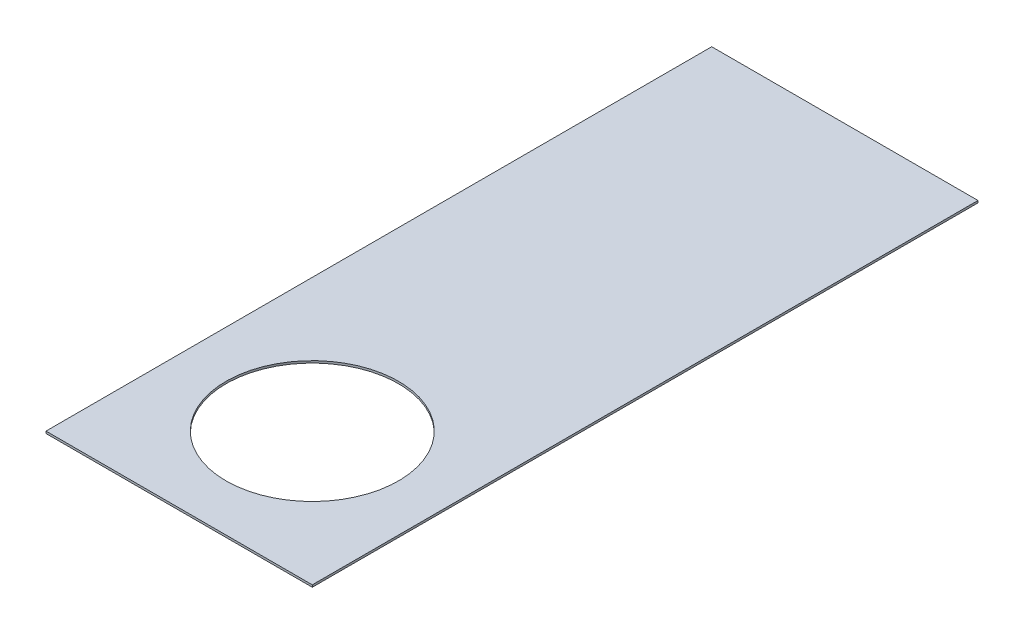
ISO-10303-21;
HEADER;
FILE_DESCRIPTION(('STEP AP214'),'2;1');
FILE_NAME('part.step','',(''),(''),'','','');
FILE_SCHEMA(('AUTOMOTIVE_DESIGN { 1 0 10303 214 1 1 1 1 }'));
ENDSEC;
DATA;
#1=APPLICATION_CONTEXT('core data for automotive mechanical design processes');
#2=APPLICATION_PROTOCOL_DEFINITION('international standard','automotive_design',2000,#1);
#3=PRODUCT_CONTEXT('',#1,'mechanical');
#4=PRODUCT('Part','Part','',(#3));
#5=PRODUCT_RELATED_PRODUCT_CATEGORY('part','',(#4));
#6=PRODUCT_DEFINITION_FORMATION('','',#4);
#7=PRODUCT_DEFINITION_CONTEXT('part definition',#1,'design');
#8=PRODUCT_DEFINITION('design','',#6,#7);
#9=PRODUCT_DEFINITION_SHAPE('','',#8);
#10=(LENGTH_UNIT() NAMED_UNIT(*) SI_UNIT(.MILLI.,.METRE.));
#11=(NAMED_UNIT(*) PLANE_ANGLE_UNIT() SI_UNIT($,.RADIAN.));
#12=(NAMED_UNIT(*) SI_UNIT($,.STERADIAN.) SOLID_ANGLE_UNIT());
#13=UNCERTAINTY_MEASURE_WITH_UNIT(LENGTH_MEASURE(1.E-05),#10,'distance_accuracy_value','');
#14=(GEOMETRIC_REPRESENTATION_CONTEXT(3) GLOBAL_UNCERTAINTY_ASSIGNED_CONTEXT((#13)) GLOBAL_UNIT_ASSIGNED_CONTEXT((#10,
#11,#12)) REPRESENTATION_CONTEXT('',''));
#15=CARTESIAN_POINT('',(0.,0.,0.));
#16=DIRECTION('',(0.,0.,1.));
#17=DIRECTION('',(1.,0.,0.));
#18=AXIS2_PLACEMENT_3D('',#15,#16,#17);
#19=CARTESIAN_POINT('',(1.5875,0.0254,-3.96875));
#20=DIRECTION('',(-1.,0.,0.));
#21=DIRECTION('',(0.,0.,1.));
#22=AXIS2_PLACEMENT_3D('',#19,#20,#21);
#23=PLANE('',#22);
#24=DIRECTION('',(0.,0.,-1.));
#25=VECTOR('',#24,1.);
#26=CARTESIAN_POINT('',(1.5875,0.,-3.96875));
#27=LINE('',#26,#25);
#28=CARTESIAN_POINT('',(1.5875,0.,3.96875));
#29=VERTEX_POINT('',#28);
#30=CARTESIAN_POINT('',(1.5875,0.,-3.96875));
#31=VERTEX_POINT('',#30);
#32=EDGE_CURVE('E96',#29,#31,#27,.T.);
#33=ORIENTED_EDGE('',*,*,#32,.T.);
#34=DIRECTION('',(0.,-1.,0.));
#35=VECTOR('',#34,1.);
#36=CARTESIAN_POINT('',(1.5875,0.0254,-3.96875));
#37=LINE('',#36,#35);
#38=CARTESIAN_POINT('',(1.5875,0.0254,-3.96875));
#39=VERTEX_POINT('',#38);
#40=EDGE_CURVE('E11',#39,#31,#37,.T.);
#41=ORIENTED_EDGE('',*,*,#40,.F.);
#42=DIRECTION('',(0.,0.,-1.));
#43=VECTOR('',#42,1.);
#44=CARTESIAN_POINT('',(1.5875,0.0254,-3.96875));
#45=LINE('',#44,#43);
#46=CARTESIAN_POINT('',(1.5875,0.0254,3.96875));
#47=VERTEX_POINT('',#46);
#48=EDGE_CURVE('E84',#47,#39,#45,.T.);
#49=ORIENTED_EDGE('',*,*,#48,.F.);
#50=DIRECTION('',(0.,-1.,0.));
#51=VECTOR('',#50,1.);
#52=CARTESIAN_POINT('',(1.5875,0.0254,3.96875));
#53=LINE('',#52,#51);
#54=EDGE_CURVE('E92',#47,#29,#53,.T.);
#55=ORIENTED_EDGE('',*,*,#54,.T.);
#56=EDGE_LOOP('',(#33,#41,#49,#55));
#57=FACE_BOUND('',#56,.T.);
#58=ADVANCED_FACE('F33',(#57),#23,.F.);
#59=CARTESIAN_POINT('',(-1.5875,0.0254,-3.96875));
#60=DIRECTION('',(0.,0.,1.));
#61=DIRECTION('',(1.,0.,0.));
#62=AXIS2_PLACEMENT_3D('',#59,#60,#61);
#63=PLANE('',#62);
#64=DIRECTION('',(-1.,0.,0.));
#65=VECTOR('',#64,1.);
#66=CARTESIAN_POINT('',(-1.5875,0.,-3.96875));
#67=LINE('',#66,#65);
#68=CARTESIAN_POINT('',(-1.5875,0.,-3.96875));
#69=VERTEX_POINT('',#68);
#70=EDGE_CURVE('E88',#31,#69,#67,.T.);
#71=ORIENTED_EDGE('',*,*,#70,.T.);
#72=DIRECTION('',(0.,-1.,0.));
#73=VECTOR('',#72,1.);
#74=CARTESIAN_POINT('',(-1.5875,0.0254,-3.96875));
#75=LINE('',#74,#73);
#76=CARTESIAN_POINT('',(-1.5875,0.0254,-3.96875));
#77=VERTEX_POINT('',#76);
#78=EDGE_CURVE('E41',#77,#69,#75,.T.);
#79=ORIENTED_EDGE('',*,*,#78,.F.);
#80=DIRECTION('',(-1.,0.,0.));
#81=VECTOR('',#80,1.);
#82=CARTESIAN_POINT('',(-1.5875,0.0254,-3.96875));
#83=LINE('',#82,#81);
#84=EDGE_CURVE('E79',#39,#77,#83,.T.);
#85=ORIENTED_EDGE('',*,*,#84,.F.);
#86=ORIENTED_EDGE('',*,*,#40,.T.);
#87=EDGE_LOOP('',(#71,#79,#85,#86));
#88=FACE_BOUND('',#87,.T.);
#89=ADVANCED_FACE('F87',(#88),#63,.F.);
#90=CARTESIAN_POINT('',(-1.5875,0.0254,-3.96875));
#91=DIRECTION('',(1.,0.,0.));
#92=DIRECTION('',(0.,0.,-1.));
#93=AXIS2_PLACEMENT_3D('',#90,#91,#92);
#94=PLANE('',#93);
#95=DIRECTION('',(0.,0.,1.));
#96=VECTOR('',#95,1.);
#97=CARTESIAN_POINT('',(-1.5875,0.,-3.96875));
#98=LINE('',#97,#96);
#99=CARTESIAN_POINT('',(-1.5875,0.,3.96875));
#100=VERTEX_POINT('',#99);
#101=EDGE_CURVE('E66',#69,#100,#98,.T.);
#102=ORIENTED_EDGE('',*,*,#101,.T.);
#103=DIRECTION('',(0.,-1.,0.));
#104=VECTOR('',#103,1.);
#105=CARTESIAN_POINT('',(-1.5875,0.0254,3.96875));
#106=LINE('',#105,#104);
#107=CARTESIAN_POINT('',(-1.5875,0.0254,3.96875));
#108=VERTEX_POINT('',#107);
#109=EDGE_CURVE('E89',#108,#100,#106,.T.);
#110=ORIENTED_EDGE('',*,*,#109,.F.);
#111=DIRECTION('',(0.,0.,1.));
#112=VECTOR('',#111,1.);
#113=CARTESIAN_POINT('',(-1.5875,0.0254,-3.96875));
#114=LINE('',#113,#112);
#115=EDGE_CURVE('E82',#77,#108,#114,.T.);
#116=ORIENTED_EDGE('',*,*,#115,.F.);
#117=ORIENTED_EDGE('',*,*,#78,.T.);
#118=EDGE_LOOP('',(#102,#110,#116,#117));
#119=FACE_BOUND('',#118,.T.);
#120=ADVANCED_FACE('F90',(#119),#94,.F.);
#121=CARTESIAN_POINT('',(-1.5875,0.0254,3.96875));
#122=DIRECTION('',(0.,0.,-1.));
#123=DIRECTION('',(-1.,0.,0.));
#124=AXIS2_PLACEMENT_3D('',#121,#122,#123);
#125=PLANE('',#124);
#126=DIRECTION('',(1.,0.,0.));
#127=VECTOR('',#126,1.);
#128=CARTESIAN_POINT('',(-1.5875,0.,3.96875));
#129=LINE('',#128,#127);
#130=EDGE_CURVE('E72',#100,#29,#129,.T.);
#131=ORIENTED_EDGE('',*,*,#130,.T.);
#132=ORIENTED_EDGE('',*,*,#54,.F.);
#133=DIRECTION('',(1.,0.,0.));
#134=VECTOR('',#133,1.);
#135=CARTESIAN_POINT('',(-1.5875,0.0254,3.96875));
#136=LINE('',#135,#134);
#137=EDGE_CURVE('E49',#108,#47,#136,.T.);
#138=ORIENTED_EDGE('',*,*,#137,.F.);
#139=ORIENTED_EDGE('',*,*,#109,.T.);
#140=EDGE_LOOP('',(#131,#132,#138,#139));
#141=FACE_BOUND('',#140,.T.);
#142=ADVANCED_FACE('F104',(#141),#125,.F.);
#143=CARTESIAN_POINT('',(0.,0.0254,0.));
#144=DIRECTION('',(0.,1.,0.));
#145=DIRECTION('',(0.,0.,1.));
#146=AXIS2_PLACEMENT_3D('',#143,#144,#145);
#147=PLANE('',#146);
#148=CARTESIAN_POINT('',(0.,0.0254000000000001,2.38125));
#149=DIRECTION('',(0.,1.,0.));
#150=DIRECTION('',(0.,0.,1.));
#151=AXIS2_PLACEMENT_3D('',#148,#149,#150);
#152=CIRCLE('',#151,1.0287);
#153=CARTESIAN_POINT('',(0.,0.0254000000000001,3.40995));
#154=VERTEX_POINT('',#153);
#155=EDGE_CURVE('E112',#154,#154,#152,.T.);
#156=ORIENTED_EDGE('',*,*,#155,.F.);
#157=EDGE_LOOP('',(#156));
#158=FACE_BOUND('',#157,.T.);
#159=ORIENTED_EDGE('',*,*,#48,.T.);
#160=ORIENTED_EDGE('',*,*,#84,.T.);
#161=ORIENTED_EDGE('',*,*,#115,.T.);
#162=ORIENTED_EDGE('',*,*,#137,.T.);
#163=EDGE_LOOP('',(#159,#160,#161,#162));
#164=FACE_BOUND('',#163,.T.);
#165=ADVANCED_FACE('F80',(#158,#164),#147,.T.);
#166=CARTESIAN_POINT('',(0.,0.,0.));
#167=DIRECTION('',(0.,1.,0.));
#168=DIRECTION('',(0.,0.,1.));
#169=AXIS2_PLACEMENT_3D('',#166,#167,#168);
#170=PLANE('',#169);
#171=CARTESIAN_POINT('',(0.,0.,2.38125));
#172=DIRECTION('',(0.,1.,0.));
#173=DIRECTION('',(0.,0.,1.));
#174=AXIS2_PLACEMENT_3D('',#171,#172,#173);
#175=CIRCLE('',#174,1.0287);
#176=CARTESIAN_POINT('',(0.,0.,3.40995));
#177=VERTEX_POINT('',#176);
#178=EDGE_CURVE('E99',#177,#177,#175,.T.);
#179=ORIENTED_EDGE('',*,*,#178,.T.);
#180=EDGE_LOOP('',(#179));
#181=FACE_BOUND('',#180,.T.);
#182=ORIENTED_EDGE('',*,*,#32,.F.);
#183=ORIENTED_EDGE('',*,*,#130,.F.);
#184=ORIENTED_EDGE('',*,*,#101,.F.);
#185=ORIENTED_EDGE('',*,*,#70,.F.);
#186=EDGE_LOOP('',(#182,#183,#184,#185));
#187=FACE_BOUND('',#186,.T.);
#188=ADVANCED_FACE('F107',(#181,#187),#170,.F.);
#189=CARTESIAN_POINT('',(0.,0.0254,2.38125));
#190=DIRECTION('',(0.,1.,0.));
#191=DIRECTION('',(0.,0.,1.));
#192=AXIS2_PLACEMENT_3D('',#189,#190,#191);
#193=CYLINDRICAL_SURFACE('',#192,1.0287);
#194=ORIENTED_EDGE('',*,*,#178,.F.);
#195=EDGE_LOOP('',(#194));
#196=FACE_BOUND('',#195,.T.);
#197=ORIENTED_EDGE('',*,*,#155,.T.);
#198=EDGE_LOOP('',(#197));
#199=FACE_BOUND('',#198,.T.);
#200=ADVANCED_FACE('F116',(#196,#199),#193,.F.);
#201=CLOSED_SHELL('',(#58,#89,#120,#142,#165,#188,#200));
#202=MANIFOLD_SOLID_BREP('B2',#201);
#203=ADVANCED_BREP_SHAPE_REPRESENTATION('',(#18,#202),#14);
#204=SHAPE_DEFINITION_REPRESENTATION(#9,#203);
ENDSEC;
END-ISO-10303-21;
